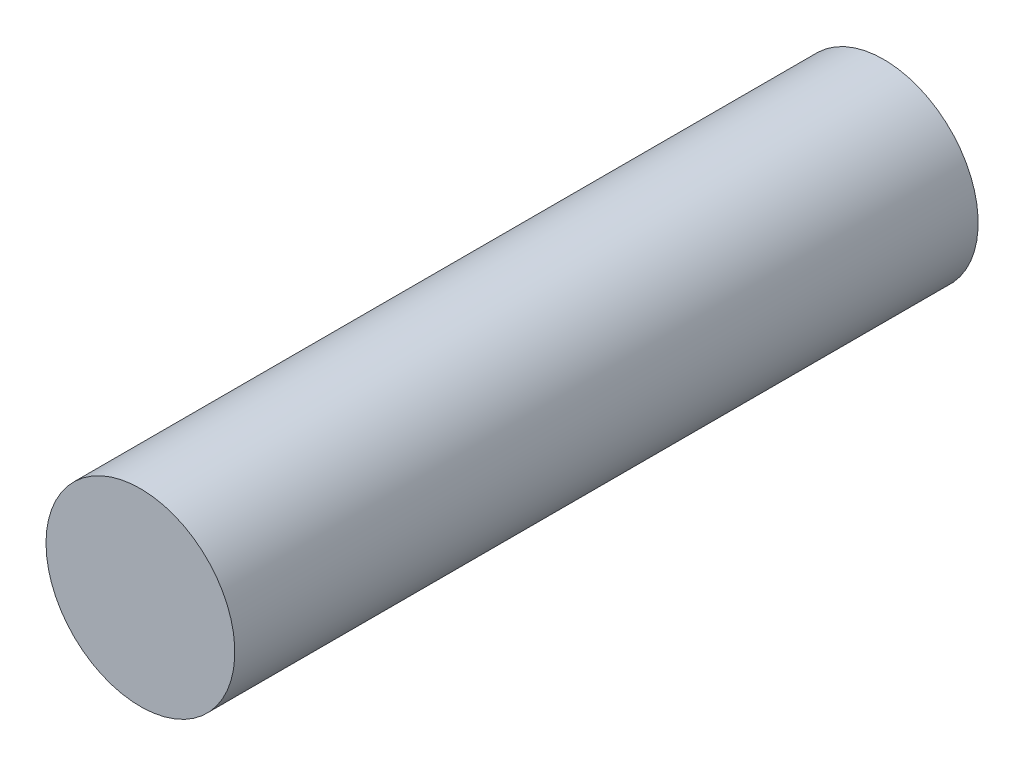
ISO-10303-21;
HEADER;
FILE_DESCRIPTION(('STEP AP214'),'2;1');
FILE_NAME('part.step','',(''),(''),'','','');
FILE_SCHEMA(('AUTOMOTIVE_DESIGN { 1 0 10303 214 1 1 1 1 }'));
ENDSEC;
DATA;
#1=APPLICATION_CONTEXT('core data for automotive mechanical design processes');
#2=APPLICATION_PROTOCOL_DEFINITION('international standard','automotive_design',2000,#1);
#3=PRODUCT_CONTEXT('',#1,'mechanical');
#4=PRODUCT('Part','Part','',(#3));
#5=PRODUCT_RELATED_PRODUCT_CATEGORY('part','',(#4));
#6=PRODUCT_DEFINITION_FORMATION('','',#4);
#7=PRODUCT_DEFINITION_CONTEXT('part definition',#1,'design');
#8=PRODUCT_DEFINITION('design','',#6,#7);
#9=PRODUCT_DEFINITION_SHAPE('','',#8);
#10=(LENGTH_UNIT() NAMED_UNIT(*) SI_UNIT(.MILLI.,.METRE.));
#11=(NAMED_UNIT(*) PLANE_ANGLE_UNIT() SI_UNIT($,.RADIAN.));
#12=(NAMED_UNIT(*) SI_UNIT($,.STERADIAN.) SOLID_ANGLE_UNIT());
#13=UNCERTAINTY_MEASURE_WITH_UNIT(LENGTH_MEASURE(1.E-05),#10,'distance_accuracy_value','');
#14=(GEOMETRIC_REPRESENTATION_CONTEXT(3) GLOBAL_UNCERTAINTY_ASSIGNED_CONTEXT((#13)) GLOBAL_UNIT_ASSIGNED_CONTEXT((#10,
#11,#12)) REPRESENTATION_CONTEXT('',''));
#15=CARTESIAN_POINT('',(0.,0.,0.));
#16=DIRECTION('',(0.,0.,1.));
#17=DIRECTION('',(1.,0.,0.));
#18=AXIS2_PLACEMENT_3D('',#15,#16,#17);
#19=CARTESIAN_POINT('',(0.,0.,1.00000000000006));
#20=DIRECTION('',(0.,0.,1.));
#21=DIRECTION('',(1.,0.,0.));
#22=AXIS2_PLACEMENT_3D('',#19,#20,#21);
#23=PLANE('',#22);
#24=CARTESIAN_POINT('',(0.,0.,1.00000000000006));
#25=DIRECTION('',(0.,0.,1.));
#26=DIRECTION('',(-1.,0.,0.));
#27=AXIS2_PLACEMENT_3D('',#24,#25,#26);
#28=CIRCLE('',#27,0.127);
#29=CARTESIAN_POINT('',(-0.127,0.,1.00000000000006));
#30=VERTEX_POINT('',#29);
#31=EDGE_CURVE('E25',#30,#30,#28,.T.);
#32=ORIENTED_EDGE('',*,*,#31,.T.);
#33=EDGE_LOOP('',(#32));
#34=FACE_BOUND('',#33,.T.);
#35=ADVANCED_FACE('F16',(#34),#23,.T.);
#36=CARTESIAN_POINT('',(0.,0.,0.));
#37=DIRECTION('',(0.,0.,1.));
#38=DIRECTION('',(1.,0.,0.));
#39=AXIS2_PLACEMENT_3D('',#36,#37,#38);
#40=CYLINDRICAL_SURFACE('',#39,0.127);
#41=ORIENTED_EDGE('',*,*,#31,.F.);
#42=DIRECTION('',(0.,0.,-1.));
#43=VECTOR('',#42,1.);
#44=CARTESIAN_POINT('',(-0.127,0.,0.));
#45=LINE('',#44,#43);
#46=CARTESIAN_POINT('',(-0.127,0.,0.));
#47=VERTEX_POINT('',#46);
#48=EDGE_CURVE('E11',#30,#47,#45,.T.);
#49=ORIENTED_EDGE('',*,*,#48,.T.);
#50=CARTESIAN_POINT('',(0.,0.,0.));
#51=DIRECTION('',(0.,0.,1.));
#52=DIRECTION('',(-1.,0.,0.));
#53=AXIS2_PLACEMENT_3D('',#50,#51,#52);
#54=CIRCLE('',#53,0.127);
#55=EDGE_CURVE('E41',#47,#47,#54,.T.);
#56=ORIENTED_EDGE('',*,*,#55,.T.);
#57=ORIENTED_EDGE('',*,*,#48,.F.);
#58=EDGE_LOOP('',(#41,#49,#56,#57));
#59=FACE_BOUND('',#58,.T.);
#60=ADVANCED_FACE('F39',(#59),#40,.T.);
#61=CARTESIAN_POINT('',(0.,0.,0.));
#62=DIRECTION('',(0.,0.,1.));
#63=DIRECTION('',(1.,0.,0.));
#64=AXIS2_PLACEMENT_3D('',#61,#62,#63);
#65=PLANE('',#64);
#66=ORIENTED_EDGE('',*,*,#55,.F.);
#67=EDGE_LOOP('',(#66));
#68=FACE_BOUND('',#67,.T.);
#69=ADVANCED_FACE('F18',(#68),#65,.F.);
#70=CLOSED_SHELL('',(#35,#60,#69));
#71=MANIFOLD_SOLID_BREP('B1',#70);
#72=ADVANCED_BREP_SHAPE_REPRESENTATION('',(#18,#71),#14);
#73=SHAPE_DEFINITION_REPRESENTATION(#9,#72);
ENDSEC;
END-ISO-10303-21;
